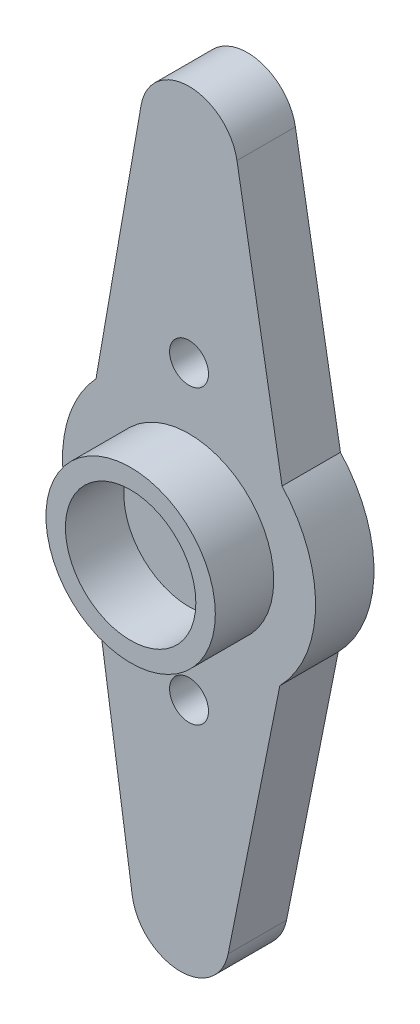
ISO-10303-21;
HEADER;
FILE_DESCRIPTION(('STEP AP214'),'2;1');
FILE_NAME('part.step','',(''),(''),'','','');
FILE_SCHEMA(('AUTOMOTIVE_DESIGN { 1 0 10303 214 1 1 1 1 }'));
ENDSEC;
DATA;
#1=APPLICATION_CONTEXT('core data for automotive mechanical design processes');
#2=APPLICATION_PROTOCOL_DEFINITION('international standard','automotive_design',2000,#1);
#3=PRODUCT_CONTEXT('',#1,'mechanical');
#4=PRODUCT('Part','Part','',(#3));
#5=PRODUCT_RELATED_PRODUCT_CATEGORY('part','',(#4));
#6=PRODUCT_DEFINITION_FORMATION('','',#4);
#7=PRODUCT_DEFINITION_CONTEXT('part definition',#1,'design');
#8=PRODUCT_DEFINITION('design','',#6,#7);
#9=PRODUCT_DEFINITION_SHAPE('','',#8);
#10=(LENGTH_UNIT() NAMED_UNIT(*) SI_UNIT(.MILLI.,.METRE.));
#11=(NAMED_UNIT(*) PLANE_ANGLE_UNIT() SI_UNIT($,.RADIAN.));
#12=(NAMED_UNIT(*) SI_UNIT($,.STERADIAN.) SOLID_ANGLE_UNIT());
#13=UNCERTAINTY_MEASURE_WITH_UNIT(LENGTH_MEASURE(1.E-05),#10,'distance_accuracy_value','');
#14=(GEOMETRIC_REPRESENTATION_CONTEXT(3) GLOBAL_UNCERTAINTY_ASSIGNED_CONTEXT((#13)) GLOBAL_UNIT_ASSIGNED_CONTEXT((#10,
#11,#12)) REPRESENTATION_CONTEXT('',''));
#15=CARTESIAN_POINT('',(0.,0.,0.));
#16=DIRECTION('',(0.,0.,1.));
#17=DIRECTION('',(1.,0.,0.));
#18=AXIS2_PLACEMENT_3D('',#15,#16,#17);
#19=CARTESIAN_POINT('',(0.,17.3,3.));
#20=DIRECTION('',(0.,0.,1.));
#21=DIRECTION('',(1.,0.,0.));
#22=AXIS2_PLACEMENT_3D('',#19,#20,#21);
#23=PLANE('',#22);
#24=CARTESIAN_POINT('',(0.,7.5,3.));
#25=DIRECTION('',(0.,0.,1.));
#26=DIRECTION('',(1.,0.,0.));
#27=AXIS2_PLACEMENT_3D('',#24,#25,#26);
#28=CIRCLE('',#27,1.);
#29=CARTESIAN_POINT('',(1.,7.5,3.));
#30=VERTEX_POINT('',#29);
#31=EDGE_CURVE('E145',#30,#30,#28,.T.);
#32=ORIENTED_EDGE('',*,*,#31,.F.);
#33=EDGE_LOOP('',(#32));
#34=FACE_BOUND('',#33,.T.);
#35=CARTESIAN_POINT('',(0.,17.3,3.));
#36=DIRECTION('',(0.,0.,1.));
#37=DIRECTION('',(1.,0.,0.));
#38=AXIS2_PLACEMENT_3D('',#35,#36,#37);
#39=CIRCLE('',#38,2.5);
#40=CARTESIAN_POINT('',(2.46310423726699,17.7279223251449,3.));
#41=VERTEX_POINT('',#40);
#42=CARTESIAN_POINT('',(-2.46310423726699,17.7279223251449,3.));
#43=VERTEX_POINT('',#42);
#44=EDGE_CURVE('E156',#41,#43,#39,.T.);
#45=ORIENTED_EDGE('',*,*,#44,.T.);
#46=DIRECTION('',(-0.171168930057945,-0.985241694906797,0.));
#47=VECTOR('',#46,1.);
#48=CARTESIAN_POINT('',(-2.46310423726699,17.7279223251449,3.));
#49=LINE('',#48,#47);
#50=CARTESIAN_POINT('',(-4.777267610958,4.40768807577075,3.));
#51=VERTEX_POINT('',#50);
#52=EDGE_CURVE('E104',#43,#51,#49,.T.);
#53=ORIENTED_EDGE('',*,*,#52,.T.);
#54=CARTESIAN_POINT('',(0.,0.,3.));
#55=DIRECTION('',(0.,0.,1.));
#56=DIRECTION('',(1.,0.,0.));
#57=AXIS2_PLACEMENT_3D('',#54,#55,#56);
#58=CIRCLE('',#57,6.5);
#59=CARTESIAN_POINT('',(-4.88834608131742,-4.28416533169165,3.));
#60=VERTEX_POINT('',#59);
#61=EDGE_CURVE('E188',#51,#60,#58,.T.);
#62=ORIENTED_EDGE('',*,*,#61,.T.);
#63=DIRECTION('',(0.145935137887249,-0.989294160262674,0.));
#64=VECTOR('',#63,1.);
#65=CARTESIAN_POINT('',(-2.91533759830071,-17.6591879523931,3.));
#66=LINE('',#65,#64);
#67=CARTESIAN_POINT('',(-2.91533759830071,-17.6591879523931,3.));
#68=VERTEX_POINT('',#67);
#69=EDGE_CURVE('E187',#60,#68,#66,.T.);
#70=ORIENTED_EDGE('',*,*,#69,.T.);
#71=CARTESIAN_POINT('',(-0.44210219764402,-17.294350107675,3.));
#72=DIRECTION('',(0.,0.,1.));
#73=DIRECTION('',(1.,0.,0.));
#74=AXIS2_PLACEMENT_3D('',#71,#72,#73);
#75=CIRCLE('',#74,2.5);
#76=CARTESIAN_POINT('',(2.00926205846151,-17.7850774086153,3.));
#77=VERTEX_POINT('',#76);
#78=EDGE_CURVE('E123',#68,#77,#75,.T.);
#79=ORIENTED_EDGE('',*,*,#78,.T.);
#80=DIRECTION('',(0.19629092037613,0.980545702442213,0.));
#81=VECTOR('',#80,1.);
#82=CARTESIAN_POINT('',(2.00926205846151,-17.7850774086153,3.));
#83=LINE('',#82,#81);
#84=CARTESIAN_POINT('',(4.66306878827377,-4.52833186458623,3.));
#85=VERTEX_POINT('',#84);
#86=EDGE_CURVE('E117',#77,#85,#83,.T.);
#87=ORIENTED_EDGE('',*,*,#86,.T.);
#88=CARTESIAN_POINT('',(0.,0.,3.));
#89=DIRECTION('',(0.,0.,1.));
#90=DIRECTION('',(1.,0.,0.));
#91=AXIS2_PLACEMENT_3D('',#88,#89,#90);
#92=CIRCLE('',#91,6.5);
#93=CARTESIAN_POINT('',(4.777267610958,4.40768807577075,3.));
#94=VERTEX_POINT('',#93);
#95=EDGE_CURVE('E121',#85,#94,#92,.T.);
#96=ORIENTED_EDGE('',*,*,#95,.T.);
#97=DIRECTION('',(-0.171168930057945,0.985241694906797,0.));
#98=VECTOR('',#97,1.);
#99=CARTESIAN_POINT('',(2.46310423726699,17.7279223251449,3.));
#100=LINE('',#99,#98);
#101=EDGE_CURVE('E60',#94,#41,#100,.T.);
#102=ORIENTED_EDGE('',*,*,#101,.T.);
#103=EDGE_LOOP('',(#45,#53,#62,#70,#79,#87,#96,#102));
#104=FACE_BOUND('',#103,.T.);
#105=CARTESIAN_POINT('',(0.,-7.5,3.));
#106=DIRECTION('',(0.,0.,1.));
#107=DIRECTION('',(1.,0.,0.));
#108=AXIS2_PLACEMENT_3D('',#105,#106,#107);
#109=CIRCLE('',#108,1.);
#110=CARTESIAN_POINT('',(0.999999999999948,-7.5,3.));
#111=VERTEX_POINT('',#110);
#112=EDGE_CURVE('E197',#111,#111,#109,.T.);
#113=ORIENTED_EDGE('',*,*,#112,.F.);
#114=EDGE_LOOP('',(#113));
#115=FACE_BOUND('',#114,.T.);
#116=CARTESIAN_POINT('',(0.,0.,3.));
#117=DIRECTION('',(0.,0.,1.));
#118=DIRECTION('',(1.,0.,0.));
#119=AXIS2_PLACEMENT_3D('',#116,#117,#118);
#120=CIRCLE('',#119,4.35);
#121=CARTESIAN_POINT('',(4.35,0.,3.));
#122=VERTEX_POINT('',#121);
#123=EDGE_CURVE('E209',#122,#122,#120,.T.);
#124=ORIENTED_EDGE('',*,*,#123,.F.);
#125=EDGE_LOOP('',(#124));
#126=FACE_BOUND('',#125,.T.);
#127=ADVANCED_FACE('F43',(#34,#104,#115,#126),#23,.T.);
#128=CARTESIAN_POINT('',(0.,17.3,0.));
#129=DIRECTION('',(0.,0.,1.));
#130=DIRECTION('',(1.,0.,0.));
#131=AXIS2_PLACEMENT_3D('',#128,#129,#130);
#132=PLANE('',#131);
#133=CARTESIAN_POINT('',(0.,7.5,0.));
#134=DIRECTION('',(0.,0.,1.));
#135=DIRECTION('',(1.,0.,0.));
#136=AXIS2_PLACEMENT_3D('',#133,#134,#135);
#137=CIRCLE('',#136,1.);
#138=CARTESIAN_POINT('',(1.,7.5,0.));
#139=VERTEX_POINT('',#138);
#140=EDGE_CURVE('E194',#139,#139,#137,.T.);
#141=ORIENTED_EDGE('',*,*,#140,.T.);
#142=EDGE_LOOP('',(#141));
#143=FACE_BOUND('',#142,.T.);
#144=CARTESIAN_POINT('',(0.,17.3,0.));
#145=DIRECTION('',(0.,0.,1.));
#146=DIRECTION('',(1.,0.,0.));
#147=AXIS2_PLACEMENT_3D('',#144,#145,#146);
#148=CIRCLE('',#147,2.5);
#149=CARTESIAN_POINT('',(2.46310423726699,17.7279223251449,0.));
#150=VERTEX_POINT('',#149);
#151=CARTESIAN_POINT('',(-2.46310423726699,17.7279223251449,0.));
#152=VERTEX_POINT('',#151);
#153=EDGE_CURVE('E141',#150,#152,#148,.T.);
#154=ORIENTED_EDGE('',*,*,#153,.F.);
#155=DIRECTION('',(-0.171168930057945,0.985241694906797,0.));
#156=VECTOR('',#155,1.);
#157=CARTESIAN_POINT('',(2.46310423726699,17.7279223251449,0.));
#158=LINE('',#157,#156);
#159=CARTESIAN_POINT('',(4.777267610958,4.40768807577075,0.));
#160=VERTEX_POINT('',#159);
#161=EDGE_CURVE('E95',#160,#150,#158,.T.);
#162=ORIENTED_EDGE('',*,*,#161,.F.);
#163=CARTESIAN_POINT('',(0.,0.,0.));
#164=DIRECTION('',(0.,0.,1.));
#165=DIRECTION('',(1.,0.,0.));
#166=AXIS2_PLACEMENT_3D('',#163,#164,#165);
#167=CIRCLE('',#166,6.5);
#168=CARTESIAN_POINT('',(4.66306878827377,-4.52833186458623,0.));
#169=VERTEX_POINT('',#168);
#170=EDGE_CURVE('E89',#169,#160,#167,.T.);
#171=ORIENTED_EDGE('',*,*,#170,.F.);
#172=DIRECTION('',(0.19629092037613,0.980545702442213,0.));
#173=VECTOR('',#172,1.);
#174=CARTESIAN_POINT('',(2.00926205846151,-17.7850774086153,0.));
#175=LINE('',#174,#173);
#176=CARTESIAN_POINT('',(2.00926205846151,-17.7850774086153,0.));
#177=VERTEX_POINT('',#176);
#178=EDGE_CURVE('E131',#177,#169,#175,.T.);
#179=ORIENTED_EDGE('',*,*,#178,.F.);
#180=CARTESIAN_POINT('',(-0.44210219764402,-17.294350107675,0.));
#181=DIRECTION('',(0.,0.,1.));
#182=DIRECTION('',(1.,0.,0.));
#183=AXIS2_PLACEMENT_3D('',#180,#181,#182);
#184=CIRCLE('',#183,2.5);
#185=CARTESIAN_POINT('',(-2.91533759830071,-17.6591879523931,0.));
#186=VERTEX_POINT('',#185);
#187=EDGE_CURVE('E151',#186,#177,#184,.T.);
#188=ORIENTED_EDGE('',*,*,#187,.F.);
#189=DIRECTION('',(0.145935137887249,-0.989294160262674,0.));
#190=VECTOR('',#189,1.);
#191=CARTESIAN_POINT('',(-2.91533759830071,-17.6591879523931,0.));
#192=LINE('',#191,#190);
#193=CARTESIAN_POINT('',(-4.88834608131742,-4.28416533169165,0.));
#194=VERTEX_POINT('',#193);
#195=EDGE_CURVE('E149',#194,#186,#192,.T.);
#196=ORIENTED_EDGE('',*,*,#195,.F.);
#197=CARTESIAN_POINT('',(0.,0.,0.));
#198=DIRECTION('',(0.,0.,1.));
#199=DIRECTION('',(1.,0.,0.));
#200=AXIS2_PLACEMENT_3D('',#197,#198,#199);
#201=CIRCLE('',#200,6.5);
#202=CARTESIAN_POINT('',(-4.777267610958,4.40768807577075,0.));
#203=VERTEX_POINT('',#202);
#204=EDGE_CURVE('E147',#203,#194,#201,.T.);
#205=ORIENTED_EDGE('',*,*,#204,.F.);
#206=DIRECTION('',(-0.171168930057945,-0.985241694906797,0.));
#207=VECTOR('',#206,1.);
#208=CARTESIAN_POINT('',(-2.46310423726699,17.7279223251449,0.));
#209=LINE('',#208,#207);
#210=EDGE_CURVE('E144',#152,#203,#209,.T.);
#211=ORIENTED_EDGE('',*,*,#210,.F.);
#212=EDGE_LOOP('',(#154,#162,#171,#179,#188,#196,#205,#211));
#213=FACE_BOUND('',#212,.T.);
#214=CARTESIAN_POINT('',(0.,-7.5,0.));
#215=DIRECTION('',(0.,0.,1.));
#216=DIRECTION('',(1.,0.,0.));
#217=AXIS2_PLACEMENT_3D('',#214,#215,#216);
#218=CIRCLE('',#217,1.);
#219=CARTESIAN_POINT('',(0.999999999999948,-7.5,0.));
#220=VERTEX_POINT('',#219);
#221=EDGE_CURVE('E200',#220,#220,#218,.T.);
#222=ORIENTED_EDGE('',*,*,#221,.T.);
#223=EDGE_LOOP('',(#222));
#224=FACE_BOUND('',#223,.T.);
#225=ADVANCED_FACE('F174',(#143,#213,#224),#132,.F.);
#226=CARTESIAN_POINT('',(0.,17.3,3.));
#227=DIRECTION('',(0.,0.,-1.));
#228=DIRECTION('',(-1.,0.,0.));
#229=AXIS2_PLACEMENT_3D('',#226,#227,#228);
#230=CYLINDRICAL_SURFACE('',#229,2.5);
#231=ORIENTED_EDGE('',*,*,#153,.T.);
#232=DIRECTION('',(0.,0.,-1.));
#233=VECTOR('',#232,1.);
#234=CARTESIAN_POINT('',(-2.46310423726699,17.7279223251449,3.));
#235=LINE('',#234,#233);
#236=EDGE_CURVE('E52',#43,#152,#235,.T.);
#237=ORIENTED_EDGE('',*,*,#236,.F.);
#238=ORIENTED_EDGE('',*,*,#44,.F.);
#239=DIRECTION('',(0.,0.,-1.));
#240=VECTOR('',#239,1.);
#241=CARTESIAN_POINT('',(2.46310423726699,17.7279223251449,3.));
#242=LINE('',#241,#240);
#243=EDGE_CURVE('E137',#41,#150,#242,.T.);
#244=ORIENTED_EDGE('',*,*,#243,.T.);
#245=EDGE_LOOP('',(#231,#237,#238,#244));
#246=FACE_BOUND('',#245,.T.);
#247=ADVANCED_FACE('F45',(#246),#230,.T.);
#248=CARTESIAN_POINT('',(-2.46310423726699,17.7279223251449,3.));
#249=DIRECTION('',(0.985241694906797,-0.171168930057945,0.));
#250=DIRECTION('',(0.171168930057945,0.985241694906797,0.));
#251=AXIS2_PLACEMENT_3D('',#248,#249,#250);
#252=PLANE('',#251);
#253=ORIENTED_EDGE('',*,*,#210,.T.);
#254=DIRECTION('',(0.,0.,-1.));
#255=VECTOR('',#254,1.);
#256=CARTESIAN_POINT('',(-4.777267610958,4.40768807577075,3.));
#257=LINE('',#256,#255);
#258=EDGE_CURVE('E166',#51,#203,#257,.T.);
#259=ORIENTED_EDGE('',*,*,#258,.F.);
#260=ORIENTED_EDGE('',*,*,#52,.F.);
#261=ORIENTED_EDGE('',*,*,#236,.T.);
#262=EDGE_LOOP('',(#253,#259,#260,#261));
#263=FACE_BOUND('',#262,.T.);
#264=ADVANCED_FACE('F169',(#263),#252,.F.);
#265=CARTESIAN_POINT('',(0.,0.,3.));
#266=DIRECTION('',(0.,0.,-1.));
#267=DIRECTION('',(-1.,0.,0.));
#268=AXIS2_PLACEMENT_3D('',#265,#266,#267);
#269=CYLINDRICAL_SURFACE('',#268,6.5);
#270=ORIENTED_EDGE('',*,*,#204,.T.);
#271=DIRECTION('',(0.,0.,-1.));
#272=VECTOR('',#271,1.);
#273=CARTESIAN_POINT('',(-4.88834608131742,-4.28416533169165,3.));
#274=LINE('',#273,#272);
#275=EDGE_CURVE('E163',#60,#194,#274,.T.);
#276=ORIENTED_EDGE('',*,*,#275,.F.);
#277=ORIENTED_EDGE('',*,*,#61,.F.);
#278=ORIENTED_EDGE('',*,*,#258,.T.);
#279=EDGE_LOOP('',(#270,#276,#277,#278));
#280=FACE_BOUND('',#279,.T.);
#281=ADVANCED_FACE('F181',(#280),#269,.T.);
#282=CARTESIAN_POINT('',(-2.91533759830071,-17.6591879523931,3.));
#283=DIRECTION('',(0.989294160262674,0.145935137887249,0.));
#284=DIRECTION('',(-0.145935137887249,0.989294160262674,0.));
#285=AXIS2_PLACEMENT_3D('',#282,#283,#284);
#286=PLANE('',#285);
#287=ORIENTED_EDGE('',*,*,#195,.T.);
#288=DIRECTION('',(0.,0.,-1.));
#289=VECTOR('',#288,1.);
#290=CARTESIAN_POINT('',(-2.91533759830071,-17.6591879523931,3.));
#291=LINE('',#290,#289);
#292=EDGE_CURVE('E160',#68,#186,#291,.T.);
#293=ORIENTED_EDGE('',*,*,#292,.F.);
#294=ORIENTED_EDGE('',*,*,#69,.F.);
#295=ORIENTED_EDGE('',*,*,#275,.T.);
#296=EDGE_LOOP('',(#287,#293,#294,#295));
#297=FACE_BOUND('',#296,.T.);
#298=ADVANCED_FACE('F185',(#297),#286,.F.);
#299=CARTESIAN_POINT('',(-0.44210219764402,-17.294350107675,3.));
#300=DIRECTION('',(0.,0.,-1.));
#301=DIRECTION('',(-1.,0.,0.));
#302=AXIS2_PLACEMENT_3D('',#299,#300,#301);
#303=CYLINDRICAL_SURFACE('',#302,2.5);
#304=ORIENTED_EDGE('',*,*,#187,.T.);
#305=DIRECTION('',(0.,0.,-1.));
#306=VECTOR('',#305,1.);
#307=CARTESIAN_POINT('',(2.00926205846151,-17.7850774086153,3.));
#308=LINE('',#307,#306);
#309=EDGE_CURVE('E132',#77,#177,#308,.T.);
#310=ORIENTED_EDGE('',*,*,#309,.F.);
#311=ORIENTED_EDGE('',*,*,#78,.F.);
#312=ORIENTED_EDGE('',*,*,#292,.T.);
#313=EDGE_LOOP('',(#304,#310,#311,#312));
#314=FACE_BOUND('',#313,.T.);
#315=ADVANCED_FACE('F307',(#314),#303,.T.);
#316=CARTESIAN_POINT('',(2.00926205846151,-17.7850774086153,3.));
#317=DIRECTION('',(-0.980545702442212,0.19629092037613,0.));
#318=DIRECTION('',(-0.19629092037613,-0.980545702442213,0.));
#319=AXIS2_PLACEMENT_3D('',#316,#317,#318);
#320=PLANE('',#319);
#321=ORIENTED_EDGE('',*,*,#178,.T.);
#322=DIRECTION('',(0.,0.,-1.));
#323=VECTOR('',#322,1.);
#324=CARTESIAN_POINT('',(4.66306878827377,-4.52833186458623,3.));
#325=LINE('',#324,#323);
#326=EDGE_CURVE('E128',#85,#169,#325,.T.);
#327=ORIENTED_EDGE('',*,*,#326,.F.);
#328=ORIENTED_EDGE('',*,*,#86,.F.);
#329=ORIENTED_EDGE('',*,*,#309,.T.);
#330=EDGE_LOOP('',(#321,#327,#328,#329));
#331=FACE_BOUND('',#330,.T.);
#332=ADVANCED_FACE('F129',(#331),#320,.F.);
#333=CARTESIAN_POINT('',(0.,0.,3.));
#334=DIRECTION('',(0.,0.,-1.));
#335=DIRECTION('',(-1.,0.,0.));
#336=AXIS2_PLACEMENT_3D('',#333,#334,#335);
#337=CYLINDRICAL_SURFACE('',#336,6.5);
#338=ORIENTED_EDGE('',*,*,#170,.T.);
#339=DIRECTION('',(0.,0.,-1.));
#340=VECTOR('',#339,1.);
#341=CARTESIAN_POINT('',(4.777267610958,4.40768807577075,3.));
#342=LINE('',#341,#340);
#343=EDGE_CURVE('E133',#94,#160,#342,.T.);
#344=ORIENTED_EDGE('',*,*,#343,.F.);
#345=ORIENTED_EDGE('',*,*,#95,.F.);
#346=ORIENTED_EDGE('',*,*,#326,.T.);
#347=EDGE_LOOP('',(#338,#344,#345,#346));
#348=FACE_BOUND('',#347,.T.);
#349=ADVANCED_FACE('F135',(#348),#337,.T.);
#350=CARTESIAN_POINT('',(2.46310423726699,17.7279223251449,3.));
#351=DIRECTION('',(-0.985241694906797,-0.171168930057945,0.));
#352=DIRECTION('',(0.171168930057945,-0.985241694906797,0.));
#353=AXIS2_PLACEMENT_3D('',#350,#351,#352);
#354=PLANE('',#353);
#355=ORIENTED_EDGE('',*,*,#161,.T.);
#356=ORIENTED_EDGE('',*,*,#243,.F.);
#357=ORIENTED_EDGE('',*,*,#101,.F.);
#358=ORIENTED_EDGE('',*,*,#343,.T.);
#359=EDGE_LOOP('',(#355,#356,#357,#358));
#360=FACE_BOUND('',#359,.T.);
#361=ADVANCED_FACE('F282',(#360),#354,.F.);
#362=CARTESIAN_POINT('',(0.,7.5,3.));
#363=DIRECTION('',(0.,0.,-1.));
#364=DIRECTION('',(-1.,0.,0.));
#365=AXIS2_PLACEMENT_3D('',#362,#363,#364);
#366=CYLINDRICAL_SURFACE('',#365,1.);
#367=ORIENTED_EDGE('',*,*,#31,.T.);
#368=EDGE_LOOP('',(#367));
#369=FACE_BOUND('',#368,.T.);
#370=ORIENTED_EDGE('',*,*,#140,.F.);
#371=EDGE_LOOP('',(#370));
#372=FACE_BOUND('',#371,.T.);
#373=ADVANCED_FACE('F229',(#369,#372),#366,.F.);
#374=CARTESIAN_POINT('',(0.,-7.5,3.));
#375=DIRECTION('',(0.,0.,-1.));
#376=DIRECTION('',(-1.,0.,0.));
#377=AXIS2_PLACEMENT_3D('',#374,#375,#376);
#378=CYLINDRICAL_SURFACE('',#377,1.);
#379=ORIENTED_EDGE('',*,*,#112,.T.);
#380=EDGE_LOOP('',(#379));
#381=FACE_BOUND('',#380,.T.);
#382=ORIENTED_EDGE('',*,*,#221,.F.);
#383=EDGE_LOOP('',(#382));
#384=FACE_BOUND('',#383,.T.);
#385=ADVANCED_FACE('F220',(#381,#384),#378,.F.);
#386=CARTESIAN_POINT('',(0.,0.,24.3036579926459));
#387=DIRECTION('',(0.,0.,-1.));
#388=DIRECTION('',(-1.,0.,0.));
#389=AXIS2_PLACEMENT_3D('',#386,#387,#388);
#390=CYLINDRICAL_SURFACE('',#389,4.35);
#391=ORIENTED_EDGE('',*,*,#123,.T.);
#392=EDGE_LOOP('',(#391));
#393=FACE_BOUND('',#392,.T.);
#394=CARTESIAN_POINT('',(0.,0.,6.));
#395=DIRECTION('',(0.,0.,1.));
#396=DIRECTION('',(1.,0.,0.));
#397=AXIS2_PLACEMENT_3D('',#394,#395,#396);
#398=CIRCLE('',#397,4.35);
#399=CARTESIAN_POINT('',(4.35,0.,6.));
#400=VERTEX_POINT('',#399);
#401=EDGE_CURVE('E203',#400,#400,#398,.T.);
#402=ORIENTED_EDGE('',*,*,#401,.F.);
#403=EDGE_LOOP('',(#402));
#404=FACE_BOUND('',#403,.T.);
#405=ADVANCED_FACE('F217',(#393,#404),#390,.T.);
#406=CARTESIAN_POINT('',(0.,0.,24.3036579926459));
#407=DIRECTION('',(0.,0.,-1.));
#408=DIRECTION('',(-1.,0.,0.));
#409=AXIS2_PLACEMENT_3D('',#406,#407,#408);
#410=CYLINDRICAL_SURFACE('',#409,3.35);
#411=CARTESIAN_POINT('',(0.,0.,3.));
#412=DIRECTION('',(0.,0.,1.));
#413=DIRECTION('',(1.,0.,0.));
#414=AXIS2_PLACEMENT_3D('',#411,#412,#413);
#415=CIRCLE('',#414,3.35);
#416=CARTESIAN_POINT('',(3.35,0.,3.));
#417=VERTEX_POINT('',#416);
#418=EDGE_CURVE('E13',#417,#417,#415,.F.);
#419=ORIENTED_EDGE('',*,*,#418,.T.);
#420=EDGE_LOOP('',(#419));
#421=FACE_BOUND('',#420,.T.);
#422=CARTESIAN_POINT('',(0.,0.,6.));
#423=DIRECTION('',(0.,0.,1.));
#424=DIRECTION('',(1.,0.,0.));
#425=AXIS2_PLACEMENT_3D('',#422,#423,#424);
#426=CIRCLE('',#425,3.35);
#427=CARTESIAN_POINT('',(3.35,0.,6.));
#428=VERTEX_POINT('',#427);
#429=EDGE_CURVE('E206',#428,#428,#426,.T.);
#430=ORIENTED_EDGE('',*,*,#429,.T.);
#431=EDGE_LOOP('',(#430));
#432=FACE_BOUND('',#431,.T.);
#433=ADVANCED_FACE('F219',(#421,#432),#410,.F.);
#434=CARTESIAN_POINT('',(0.,17.3,6.));
#435=DIRECTION('',(0.,0.,1.));
#436=DIRECTION('',(1.,0.,0.));
#437=AXIS2_PLACEMENT_3D('',#434,#435,#436);
#438=PLANE('',#437);
#439=ORIENTED_EDGE('',*,*,#429,.F.);
#440=EDGE_LOOP('',(#439));
#441=FACE_BOUND('',#440,.T.);
#442=ORIENTED_EDGE('',*,*,#401,.T.);
#443=EDGE_LOOP('',(#442));
#444=FACE_BOUND('',#443,.T.);
#445=ADVANCED_FACE('F215',(#441,#444),#438,.T.);
#446=ORIENTED_EDGE('',*,*,#418,.F.);
#447=EDGE_LOOP('',(#446));
#448=FACE_BOUND('',#447,.T.);
#449=ADVANCED_FACE('F235',(#448),#23,.T.);
#450=CLOSED_SHELL('',(#127,#225,#247,#264,#281,#298,#315,#332,#349,#361,#373,#385,#405,#433,
#445,#449));
#451=MANIFOLD_SOLID_BREP('B2',#450);
#452=ADVANCED_BREP_SHAPE_REPRESENTATION('',(#18,#451),#14);
#453=SHAPE_DEFINITION_REPRESENTATION(#9,#452);
ENDSEC;
END-ISO-10303-21;
